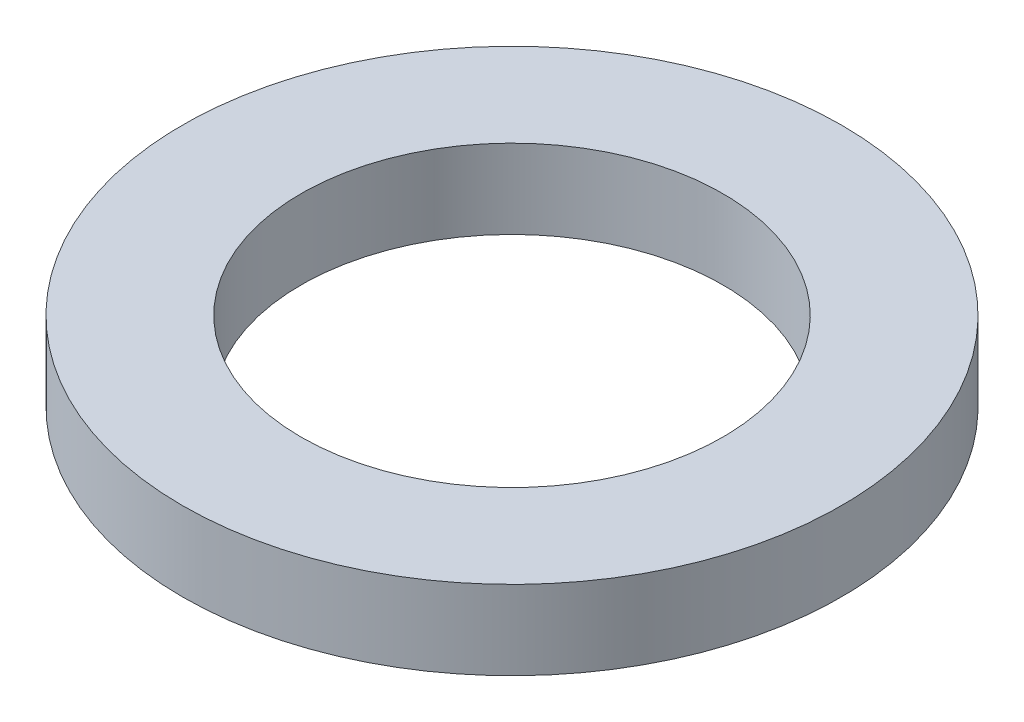
ISO-10303-21;
HEADER;
FILE_DESCRIPTION(('STEP AP214'),'2;1');
FILE_NAME('part.step','',(''),(''),'','','');
FILE_SCHEMA(('AUTOMOTIVE_DESIGN { 1 0 10303 214 1 1 1 1 }'));
ENDSEC;
DATA;
#1=APPLICATION_CONTEXT('core data for automotive mechanical design processes');
#2=APPLICATION_PROTOCOL_DEFINITION('international standard','automotive_design',2000,#1);
#3=PRODUCT_CONTEXT('',#1,'mechanical');
#4=PRODUCT('Part','Part','',(#3));
#5=PRODUCT_RELATED_PRODUCT_CATEGORY('part','',(#4));
#6=PRODUCT_DEFINITION_FORMATION('','',#4);
#7=PRODUCT_DEFINITION_CONTEXT('part definition',#1,'design');
#8=PRODUCT_DEFINITION('design','',#6,#7);
#9=PRODUCT_DEFINITION_SHAPE('','',#8);
#10=(LENGTH_UNIT() NAMED_UNIT(*) SI_UNIT(.MILLI.,.METRE.));
#11=(NAMED_UNIT(*) PLANE_ANGLE_UNIT() SI_UNIT($,.RADIAN.));
#12=(NAMED_UNIT(*) SI_UNIT($,.STERADIAN.) SOLID_ANGLE_UNIT());
#13=UNCERTAINTY_MEASURE_WITH_UNIT(LENGTH_MEASURE(1.E-05),#10,'distance_accuracy_value','');
#14=(GEOMETRIC_REPRESENTATION_CONTEXT(3) GLOBAL_UNCERTAINTY_ASSIGNED_CONTEXT((#13)) GLOBAL_UNIT_ASSIGNED_CONTEXT((#10,
#11,#12)) REPRESENTATION_CONTEXT('',''));
#15=CARTESIAN_POINT('',(0.,0.,0.));
#16=DIRECTION('',(0.,0.,1.));
#17=DIRECTION('',(1.,0.,0.));
#18=AXIS2_PLACEMENT_3D('',#15,#16,#17);
#19=CARTESIAN_POINT('',(0.,0.6,0.));
#20=DIRECTION('',(0.,1.,0.));
#21=DIRECTION('',(0.,0.,1.));
#22=AXIS2_PLACEMENT_3D('',#19,#20,#21);
#23=PLANE('',#22);
#24=CARTESIAN_POINT('',(0.,0.6,0.));
#25=DIRECTION('',(0.,1.,0.));
#26=DIRECTION('',(0.,0.,1.));
#27=AXIS2_PLACEMENT_3D('',#24,#25,#26);
#28=CIRCLE('',#27,2.5);
#29=CARTESIAN_POINT('',(0.,0.6,2.5));
#30=VERTEX_POINT('',#29);
#31=EDGE_CURVE('E10',#30,#30,#28,.T.);
#32=ORIENTED_EDGE('',*,*,#31,.T.);
#33=EDGE_LOOP('',(#32));
#34=FACE_BOUND('',#33,.T.);
#35=CARTESIAN_POINT('',(0.,0.6,0.));
#36=DIRECTION('',(0.,1.,0.));
#37=DIRECTION('',(0.,0.,1.));
#38=AXIS2_PLACEMENT_3D('',#35,#36,#37);
#39=CIRCLE('',#38,1.6);
#40=CARTESIAN_POINT('',(0.,0.6,1.6));
#41=VERTEX_POINT('',#40);
#42=EDGE_CURVE('E44',#41,#41,#39,.T.);
#43=ORIENTED_EDGE('',*,*,#42,.F.);
#44=EDGE_LOOP('',(#43));
#45=FACE_BOUND('',#44,.T.);
#46=ADVANCED_FACE('F30',(#34,#45),#23,.T.);
#47=CARTESIAN_POINT('',(0.,0.,0.));
#48=DIRECTION('',(0.,1.,0.));
#49=DIRECTION('',(0.,0.,1.));
#50=AXIS2_PLACEMENT_3D('',#47,#48,#49);
#51=PLANE('',#50);
#52=CARTESIAN_POINT('',(0.,0.,0.));
#53=DIRECTION('',(0.,1.,0.));
#54=DIRECTION('',(0.,0.,1.));
#55=AXIS2_PLACEMENT_3D('',#52,#53,#54);
#56=CIRCLE('',#55,2.5);
#57=CARTESIAN_POINT('',(0.,0.,2.5));
#58=VERTEX_POINT('',#57);
#59=EDGE_CURVE('E34',#58,#58,#56,.T.);
#60=ORIENTED_EDGE('',*,*,#59,.F.);
#61=EDGE_LOOP('',(#60));
#62=FACE_BOUND('',#61,.T.);
#63=CARTESIAN_POINT('',(0.,0.,0.));
#64=DIRECTION('',(0.,1.,0.));
#65=DIRECTION('',(0.,0.,1.));
#66=AXIS2_PLACEMENT_3D('',#63,#64,#65);
#67=CIRCLE('',#66,1.6);
#68=CARTESIAN_POINT('',(0.,0.,1.6));
#69=VERTEX_POINT('',#68);
#70=EDGE_CURVE('E46',#69,#69,#67,.T.);
#71=ORIENTED_EDGE('',*,*,#70,.T.);
#72=EDGE_LOOP('',(#71));
#73=FACE_BOUND('',#72,.T.);
#74=ADVANCED_FACE('F57',(#62,#73),#51,.F.);
#75=CARTESIAN_POINT('',(0.,0.6,0.));
#76=DIRECTION('',(0.,-1.,0.));
#77=DIRECTION('',(0.,0.,-1.));
#78=AXIS2_PLACEMENT_3D('',#75,#76,#77);
#79=CYLINDRICAL_SURFACE('',#78,2.5);
#80=ORIENTED_EDGE('',*,*,#31,.F.);
#81=EDGE_LOOP('',(#80));
#82=FACE_BOUND('',#81,.T.);
#83=ORIENTED_EDGE('',*,*,#59,.T.);
#84=EDGE_LOOP('',(#83));
#85=FACE_BOUND('',#84,.T.);
#86=ADVANCED_FACE('F32',(#82,#85),#79,.T.);
#87=CARTESIAN_POINT('',(0.,0.6,0.));
#88=DIRECTION('',(0.,-1.,0.));
#89=DIRECTION('',(0.,0.,-1.));
#90=AXIS2_PLACEMENT_3D('',#87,#88,#89);
#91=CYLINDRICAL_SURFACE('',#90,1.6);
#92=ORIENTED_EDGE('',*,*,#42,.T.);
#93=EDGE_LOOP('',(#92));
#94=FACE_BOUND('',#93,.T.);
#95=ORIENTED_EDGE('',*,*,#70,.F.);
#96=EDGE_LOOP('',(#95));
#97=FACE_BOUND('',#96,.T.);
#98=ADVANCED_FACE('F53',(#94,#97),#91,.F.);
#99=CLOSED_SHELL('',(#46,#74,#86,#98));
#100=MANIFOLD_SOLID_BREP('B2',#99);
#101=ADVANCED_BREP_SHAPE_REPRESENTATION('',(#18,#100),#14);
#102=SHAPE_DEFINITION_REPRESENTATION(#9,#101);
ENDSEC;
END-ISO-10303-21;
